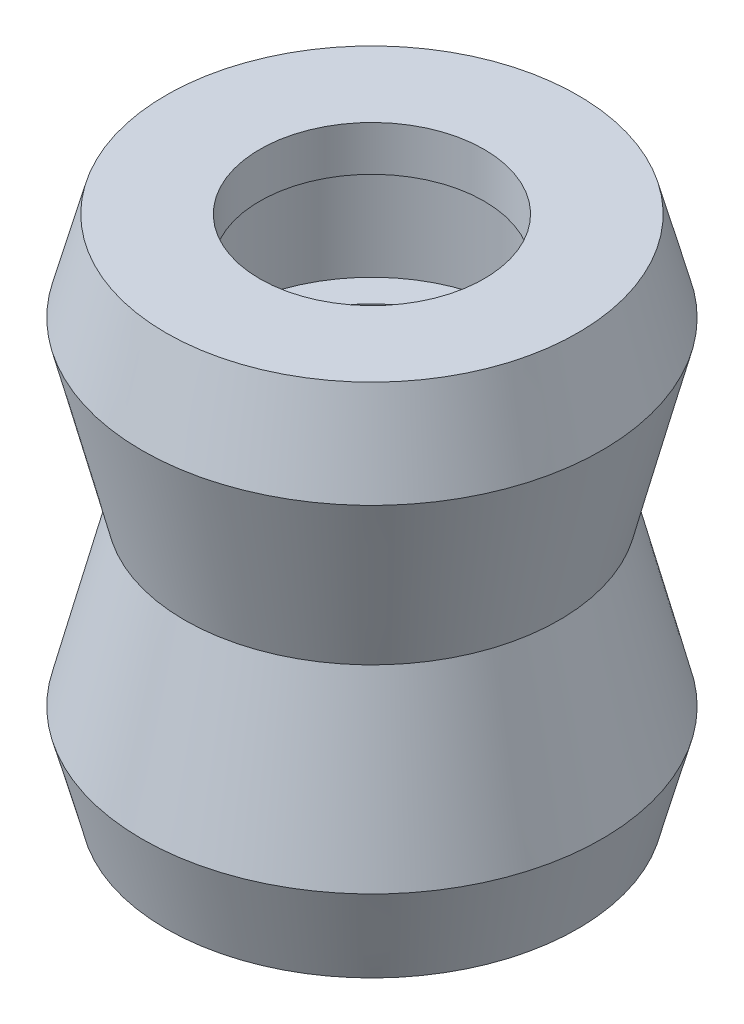
ISO-10303-21;
HEADER;
FILE_DESCRIPTION(('STEP AP214'),'2;1');
FILE_NAME('part.step','',(''),(''),'','','');
FILE_SCHEMA(('AUTOMOTIVE_DESIGN { 1 0 10303 214 1 1 1 1 }'));
ENDSEC;
DATA;
#1=APPLICATION_CONTEXT('core data for automotive mechanical design processes');
#2=APPLICATION_PROTOCOL_DEFINITION('international standard','automotive_design',2000,#1);
#3=PRODUCT_CONTEXT('',#1,'mechanical');
#4=PRODUCT('Part','Part','',(#3));
#5=PRODUCT_RELATED_PRODUCT_CATEGORY('part','',(#4));
#6=PRODUCT_DEFINITION_FORMATION('','',#4);
#7=PRODUCT_DEFINITION_CONTEXT('part definition',#1,'design');
#8=PRODUCT_DEFINITION('design','',#6,#7);
#9=PRODUCT_DEFINITION_SHAPE('','',#8);
#10=(LENGTH_UNIT() NAMED_UNIT(*) SI_UNIT(.MILLI.,.METRE.));
#11=(NAMED_UNIT(*) PLANE_ANGLE_UNIT() SI_UNIT($,.RADIAN.));
#12=(NAMED_UNIT(*) SI_UNIT($,.STERADIAN.) SOLID_ANGLE_UNIT());
#13=UNCERTAINTY_MEASURE_WITH_UNIT(LENGTH_MEASURE(1.E-05),#10,'distance_accuracy_value','');
#14=(GEOMETRIC_REPRESENTATION_CONTEXT(3) GLOBAL_UNCERTAINTY_ASSIGNED_CONTEXT((#13)) GLOBAL_UNIT_ASSIGNED_CONTEXT((#10,
#11,#12)) REPRESENTATION_CONTEXT('',''));
#15=CARTESIAN_POINT('',(0.,0.,0.));
#16=DIRECTION('',(0.,0.,1.));
#17=DIRECTION('',(1.,0.,0.));
#18=AXIS2_PLACEMENT_3D('',#15,#16,#17);
#19=CARTESIAN_POINT('',(9.17820323027549,11.5,0.));
#20=DIRECTION('',(0.,-1.,0.));
#21=DIRECTION('',(0.,0.,-1.));
#22=AXIS2_PLACEMENT_3D('',#19,#20,#21);
#23=PLANE('',#22);
#24=CARTESIAN_POINT('',(0.,11.5,0.));
#25=DIRECTION('',(0.,1.,0.));
#26=DIRECTION('',(0.,0.,1.));
#27=AXIS2_PLACEMENT_3D('',#24,#25,#26);
#28=CIRCLE('',#27,5.);
#29=CARTESIAN_POINT('',(0.,11.5,5.));
#30=VERTEX_POINT('',#29);
#31=EDGE_CURVE('E10',#30,#30,#28,.T.);
#32=ORIENTED_EDGE('',*,*,#31,.F.);
#33=EDGE_LOOP('',(#32));
#34=FACE_BOUND('',#33,.T.);
#35=CARTESIAN_POINT('',(0.,11.5,0.));
#36=DIRECTION('',(0.,1.,0.));
#37=DIRECTION('',(0.,0.,1.));
#38=AXIS2_PLACEMENT_3D('',#35,#36,#37);
#39=CIRCLE('',#38,9.17820323027549);
#40=CARTESIAN_POINT('',(0.,11.5,9.17820323027549));
#41=VERTEX_POINT('',#40);
#42=EDGE_CURVE('E72',#41,#41,#39,.T.);
#43=ORIENTED_EDGE('',*,*,#42,.T.);
#44=EDGE_LOOP('',(#43));
#45=FACE_BOUND('',#44,.T.);
#46=ADVANCED_FACE('F41',(#34,#45),#23,.F.);
#47=CARTESIAN_POINT('',(0.,11.727044646217,0.));
#48=DIRECTION('',(0.,1.,0.));
#49=DIRECTION('',(0.,0.,1.));
#50=AXIS2_PLACEMENT_3D('',#47,#48,#49);
#51=CYLINDRICAL_SURFACE('',#50,5.);
#52=CARTESIAN_POINT('',(0.,9.5,0.));
#53=DIRECTION('',(0.,1.,0.));
#54=DIRECTION('',(0.,0.,1.));
#55=AXIS2_PLACEMENT_3D('',#52,#53,#54);
#56=CIRCLE('',#55,5.);
#57=CARTESIAN_POINT('',(0.,9.5,5.));
#58=VERTEX_POINT('',#57);
#59=EDGE_CURVE('E48',#58,#58,#56,.T.);
#60=ORIENTED_EDGE('',*,*,#59,.F.);
#61=EDGE_LOOP('',(#60));
#62=FACE_BOUND('',#61,.T.);
#63=ORIENTED_EDGE('',*,*,#31,.T.);
#64=EDGE_LOOP('',(#63));
#65=FACE_BOUND('',#64,.T.);
#66=ADVANCED_FACE('F129',(#62,#65),#51,.F.);
#67=CARTESIAN_POINT('',(6.44999999999999,9.5,0.));
#68=DIRECTION('',(0.,1.,0.));
#69=DIRECTION('',(0.,0.,1.));
#70=AXIS2_PLACEMENT_3D('',#67,#68,#69);
#71=PLANE('',#70);
#72=CARTESIAN_POINT('',(0.,9.5,0.));
#73=DIRECTION('',(0.,1.,0.));
#74=DIRECTION('',(0.,0.,1.));
#75=AXIS2_PLACEMENT_3D('',#72,#73,#74);
#76=CIRCLE('',#75,6.44999999999999);
#77=CARTESIAN_POINT('',(0.,9.5,6.44999999999999));
#78=VERTEX_POINT('',#77);
#79=EDGE_CURVE('E53',#78,#78,#76,.T.);
#80=ORIENTED_EDGE('',*,*,#79,.F.);
#81=EDGE_LOOP('',(#80));
#82=FACE_BOUND('',#81,.T.);
#83=ORIENTED_EDGE('',*,*,#59,.T.);
#84=EDGE_LOOP('',(#83));
#85=FACE_BOUND('',#84,.T.);
#86=ADVANCED_FACE('F134',(#82,#85),#71,.F.);
#87=CARTESIAN_POINT('',(0.,11.727044646217,0.));
#88=DIRECTION('',(0.,1.,0.));
#89=DIRECTION('',(0.,0.,1.));
#90=AXIS2_PLACEMENT_3D('',#87,#88,#89);
#91=CYLINDRICAL_SURFACE('',#90,6.44999999999999);
#92=CARTESIAN_POINT('',(0.,4.5,0.));
#93=DIRECTION('',(0.,1.,0.));
#94=DIRECTION('',(0.,0.,1.));
#95=AXIS2_PLACEMENT_3D('',#92,#93,#94);
#96=CIRCLE('',#95,6.44999999999999);
#97=CARTESIAN_POINT('',(0.,4.5,6.44999999999999));
#98=VERTEX_POINT('',#97);
#99=EDGE_CURVE('E58',#98,#98,#96,.T.);
#100=ORIENTED_EDGE('',*,*,#99,.F.);
#101=EDGE_LOOP('',(#100));
#102=FACE_BOUND('',#101,.T.);
#103=ORIENTED_EDGE('',*,*,#79,.T.);
#104=EDGE_LOOP('',(#103));
#105=FACE_BOUND('',#104,.T.);
#106=ADVANCED_FACE('F249',(#102,#105),#91,.F.);
#107=CARTESIAN_POINT('',(6.44999999999999,4.5,0.));
#108=DIRECTION('',(0.,-1.,0.));
#109=DIRECTION('',(0.,0.,-1.));
#110=AXIS2_PLACEMENT_3D('',#107,#108,#109);
#111=PLANE('',#110);
#112=CARTESIAN_POINT('',(0.,4.5,0.));
#113=DIRECTION('',(0.,1.,0.));
#114=DIRECTION('',(0.,0.,1.));
#115=AXIS2_PLACEMENT_3D('',#112,#113,#114);
#116=CIRCLE('',#115,5.);
#117=CARTESIAN_POINT('',(0.,4.5,5.));
#118=VERTEX_POINT('',#117);
#119=EDGE_CURVE('E64',#118,#118,#116,.T.);
#120=ORIENTED_EDGE('',*,*,#119,.F.);
#121=EDGE_LOOP('',(#120));
#122=FACE_BOUND('',#121,.T.);
#123=ORIENTED_EDGE('',*,*,#99,.T.);
#124=EDGE_LOOP('',(#123));
#125=FACE_BOUND('',#124,.T.);
#126=ADVANCED_FACE('F240',(#122,#125),#111,.F.);
#127=CARTESIAN_POINT('',(0.,11.727044646217,0.));
#128=DIRECTION('',(0.,1.,0.));
#129=DIRECTION('',(0.,0.,1.));
#130=AXIS2_PLACEMENT_3D('',#127,#128,#129);
#131=CYLINDRICAL_SURFACE('',#130,5.);
#132=ORIENTED_EDGE('',*,*,#119,.T.);
#133=EDGE_LOOP('',(#132));
#134=FACE_BOUND('',#133,.T.);
#135=CARTESIAN_POINT('',(0.,-4.5,0.));
#136=DIRECTION('',(0.,1.,0.));
#137=DIRECTION('',(0.,0.,1.));
#138=AXIS2_PLACEMENT_3D('',#135,#136,#137);
#139=CIRCLE('',#138,5.);
#140=CARTESIAN_POINT('',(0.,-4.5,5.));
#141=VERTEX_POINT('',#140);
#142=EDGE_CURVE('E92',#141,#141,#139,.T.);
#143=ORIENTED_EDGE('',*,*,#142,.F.);
#144=EDGE_LOOP('',(#143));
#145=FACE_BOUND('',#144,.T.);
#146=ADVANCED_FACE('F143',(#134,#145),#131,.F.);
#147=CARTESIAN_POINT('',(0.,0.,0.));
#148=DIRECTION('',(0.,1.,0.));
#149=DIRECTION('',(0.,0.,1.));
#150=AXIS2_PLACEMENT_3D('',#147,#148,#149);
#151=CONICAL_SURFACE('',#150,8.35,0.248113449096677);
#152=CARTESIAN_POINT('',(0.,7.5,0.));
#153=DIRECTION('',(0.,1.,0.));
#154=DIRECTION('',(0.,0.,1.));
#155=AXIS2_PLACEMENT_3D('',#152,#153,#154);
#156=CIRCLE('',#155,10.25);
#157=CARTESIAN_POINT('',(0.,7.5,10.25));
#158=VERTEX_POINT('',#157);
#159=EDGE_CURVE('E68',#158,#158,#156,.T.);
#160=ORIENTED_EDGE('',*,*,#159,.F.);
#161=EDGE_LOOP('',(#160));
#162=FACE_BOUND('',#161,.T.);
#163=CARTESIAN_POINT('',(0.,0.,0.));
#164=DIRECTION('',(0.,1.,0.));
#165=DIRECTION('',(0.,0.,1.));
#166=AXIS2_PLACEMENT_3D('',#163,#164,#165);
#167=CIRCLE('',#166,8.35);
#168=CARTESIAN_POINT('',(0.,0.,8.35));
#169=VERTEX_POINT('',#168);
#170=EDGE_CURVE('E96',#169,#169,#167,.T.);
#171=ORIENTED_EDGE('',*,*,#170,.T.);
#172=EDGE_LOOP('',(#171));
#173=FACE_BOUND('',#172,.T.);
#174=ADVANCED_FACE('F125',(#162,#173),#151,.T.);
#175=CARTESIAN_POINT('',(0.,7.5,0.));
#176=DIRECTION('',(0.,-1.,0.));
#177=DIRECTION('',(0.,0.,-1.));
#178=AXIS2_PLACEMENT_3D('',#175,#176,#177);
#179=CONICAL_SURFACE('',#178,10.25,0.261799387799154);
#180=ORIENTED_EDGE('',*,*,#42,.F.);
#181=EDGE_LOOP('',(#180));
#182=FACE_BOUND('',#181,.T.);
#183=ORIENTED_EDGE('',*,*,#159,.T.);
#184=EDGE_LOOP('',(#183));
#185=FACE_BOUND('',#184,.T.);
#186=ADVANCED_FACE('F115',(#182,#185),#179,.T.);
#187=CARTESIAN_POINT('',(9.17820323027549,-11.5,0.));
#188=DIRECTION('',(0.,1.,0.));
#189=DIRECTION('',(0.,0.,-1.));
#190=AXIS2_PLACEMENT_3D('',#187,#188,#189);
#191=PLANE('',#190);
#192=CARTESIAN_POINT('',(0.,-11.5,0.));
#193=DIRECTION('',(0.,1.,0.));
#194=DIRECTION('',(0.,0.,1.));
#195=AXIS2_PLACEMENT_3D('',#192,#193,#194);
#196=CIRCLE('',#195,5.);
#197=CARTESIAN_POINT('',(0.,-11.5,5.));
#198=VERTEX_POINT('',#197);
#199=EDGE_CURVE('E76',#198,#198,#196,.T.);
#200=ORIENTED_EDGE('',*,*,#199,.T.);
#201=EDGE_LOOP('',(#200));
#202=FACE_BOUND('',#201,.T.);
#203=CARTESIAN_POINT('',(0.,-11.5,0.));
#204=DIRECTION('',(0.,1.,0.));
#205=DIRECTION('',(0.,0.,1.));
#206=AXIS2_PLACEMENT_3D('',#203,#204,#205);
#207=CIRCLE('',#206,9.17820323027549);
#208=CARTESIAN_POINT('',(0.,-11.5,9.17820323027549));
#209=VERTEX_POINT('',#208);
#210=EDGE_CURVE('E104',#209,#209,#207,.T.);
#211=ORIENTED_EDGE('',*,*,#210,.F.);
#212=EDGE_LOOP('',(#211));
#213=FACE_BOUND('',#212,.T.);
#214=ADVANCED_FACE('F112',(#202,#213),#191,.F.);
#215=CARTESIAN_POINT('',(0.,-11.727044646217,0.));
#216=DIRECTION('',(0.,-1.,0.));
#217=DIRECTION('',(0.,0.,1.));
#218=AXIS2_PLACEMENT_3D('',#215,#216,#217);
#219=CYLINDRICAL_SURFACE('',#218,5.);
#220=CARTESIAN_POINT('',(0.,-9.5,0.));
#221=DIRECTION('',(0.,1.,0.));
#222=DIRECTION('',(0.,0.,1.));
#223=AXIS2_PLACEMENT_3D('',#220,#221,#222);
#224=CIRCLE('',#223,5.);
#225=CARTESIAN_POINT('',(0.,-9.5,5.));
#226=VERTEX_POINT('',#225);
#227=EDGE_CURVE('E80',#226,#226,#224,.T.);
#228=ORIENTED_EDGE('',*,*,#227,.T.);
#229=EDGE_LOOP('',(#228));
#230=FACE_BOUND('',#229,.T.);
#231=ORIENTED_EDGE('',*,*,#199,.F.);
#232=EDGE_LOOP('',(#231));
#233=FACE_BOUND('',#232,.T.);
#234=ADVANCED_FACE('F114',(#230,#233),#219,.F.);
#235=CARTESIAN_POINT('',(6.44999999999999,-9.5,0.));
#236=DIRECTION('',(0.,-1.,0.));
#237=DIRECTION('',(0.,0.,1.));
#238=AXIS2_PLACEMENT_3D('',#235,#236,#237);
#239=PLANE('',#238);
#240=CARTESIAN_POINT('',(0.,-9.5,0.));
#241=DIRECTION('',(0.,1.,0.));
#242=DIRECTION('',(0.,0.,1.));
#243=AXIS2_PLACEMENT_3D('',#240,#241,#242);
#244=CIRCLE('',#243,6.44999999999999);
#245=CARTESIAN_POINT('',(0.,-9.5,6.44999999999999));
#246=VERTEX_POINT('',#245);
#247=EDGE_CURVE('E84',#246,#246,#244,.T.);
#248=ORIENTED_EDGE('',*,*,#247,.T.);
#249=EDGE_LOOP('',(#248));
#250=FACE_BOUND('',#249,.T.);
#251=ORIENTED_EDGE('',*,*,#227,.F.);
#252=EDGE_LOOP('',(#251));
#253=FACE_BOUND('',#252,.T.);
#254=ADVANCED_FACE('F122',(#250,#253),#239,.F.);
#255=CARTESIAN_POINT('',(0.,-11.727044646217,0.));
#256=DIRECTION('',(0.,-1.,0.));
#257=DIRECTION('',(0.,0.,1.));
#258=AXIS2_PLACEMENT_3D('',#255,#256,#257);
#259=CYLINDRICAL_SURFACE('',#258,6.44999999999999);
#260=CARTESIAN_POINT('',(0.,-4.5,0.));
#261=DIRECTION('',(0.,1.,0.));
#262=DIRECTION('',(0.,0.,1.));
#263=AXIS2_PLACEMENT_3D('',#260,#261,#262);
#264=CIRCLE('',#263,6.44999999999999);
#265=CARTESIAN_POINT('',(0.,-4.5,6.44999999999999));
#266=VERTEX_POINT('',#265);
#267=EDGE_CURVE('E88',#266,#266,#264,.T.);
#268=ORIENTED_EDGE('',*,*,#267,.T.);
#269=EDGE_LOOP('',(#268));
#270=FACE_BOUND('',#269,.T.);
#271=ORIENTED_EDGE('',*,*,#247,.F.);
#272=EDGE_LOOP('',(#271));
#273=FACE_BOUND('',#272,.T.);
#274=ADVANCED_FACE('F157',(#270,#273),#259,.F.);
#275=CARTESIAN_POINT('',(6.44999999999999,-4.5,0.));
#276=DIRECTION('',(0.,1.,0.));
#277=DIRECTION('',(0.,0.,-1.));
#278=AXIS2_PLACEMENT_3D('',#275,#276,#277);
#279=PLANE('',#278);
#280=ORIENTED_EDGE('',*,*,#142,.T.);
#281=EDGE_LOOP('',(#280));
#282=FACE_BOUND('',#281,.T.);
#283=ORIENTED_EDGE('',*,*,#267,.F.);
#284=EDGE_LOOP('',(#283));
#285=FACE_BOUND('',#284,.T.);
#286=ADVANCED_FACE('F149',(#282,#285),#279,.F.);
#287=CARTESIAN_POINT('',(0.,0.,0.));
#288=DIRECTION('',(0.,-1.,0.));
#289=DIRECTION('',(0.,0.,1.));
#290=AXIS2_PLACEMENT_3D('',#287,#288,#289);
#291=CONICAL_SURFACE('',#290,8.35,0.248113449096677);
#292=CARTESIAN_POINT('',(0.,-7.5,0.));
#293=DIRECTION('',(0.,1.,0.));
#294=DIRECTION('',(0.,0.,1.));
#295=AXIS2_PLACEMENT_3D('',#292,#293,#294);
#296=CIRCLE('',#295,10.25);
#297=CARTESIAN_POINT('',(0.,-7.5,10.25));
#298=VERTEX_POINT('',#297);
#299=EDGE_CURVE('E100',#298,#298,#296,.T.);
#300=ORIENTED_EDGE('',*,*,#299,.T.);
#301=EDGE_LOOP('',(#300));
#302=FACE_BOUND('',#301,.T.);
#303=ORIENTED_EDGE('',*,*,#170,.F.);
#304=EDGE_LOOP('',(#303));
#305=FACE_BOUND('',#304,.T.);
#306=ADVANCED_FACE('F147',(#302,#305),#291,.T.);
#307=CARTESIAN_POINT('',(0.,-7.5,0.));
#308=DIRECTION('',(0.,1.,0.));
#309=DIRECTION('',(0.,0.,-1.));
#310=AXIS2_PLACEMENT_3D('',#307,#308,#309);
#311=CONICAL_SURFACE('',#310,10.25,0.261799387799154);
#312=ORIENTED_EDGE('',*,*,#210,.T.);
#313=EDGE_LOOP('',(#312));
#314=FACE_BOUND('',#313,.T.);
#315=ORIENTED_EDGE('',*,*,#299,.F.);
#316=EDGE_LOOP('',(#315));
#317=FACE_BOUND('',#316,.T.);
#318=ADVANCED_FACE('F109',(#314,#317),#311,.T.);
#319=CLOSED_SHELL('',(#46,#66,#86,#106,#126,#146,#174,#186,#214,#234,#254,#274,#286,#306,#318));
#320=MANIFOLD_SOLID_BREP('B2',#319);
#321=ADVANCED_BREP_SHAPE_REPRESENTATION('',(#18,#320),#14);
#322=SHAPE_DEFINITION_REPRESENTATION(#9,#321);
ENDSEC;
END-ISO-10303-21;
